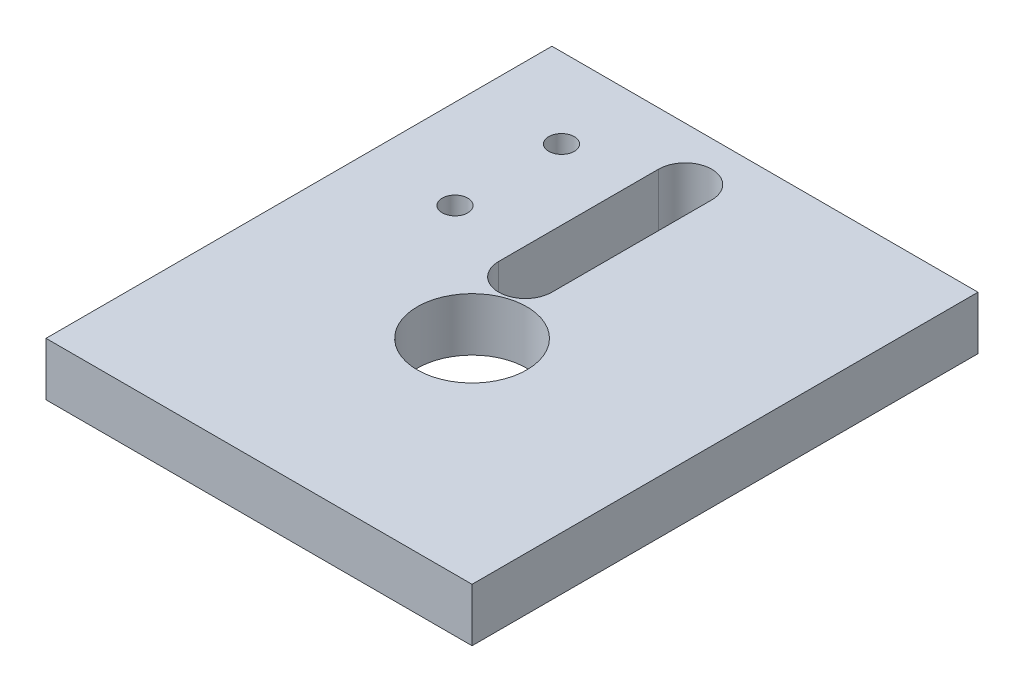
ISO-10303-21;
HEADER;
FILE_DESCRIPTION(('STEP AP214'),'2;1');
FILE_NAME('part.step','',(''),(''),'','','');
FILE_SCHEMA(('AUTOMOTIVE_DESIGN { 1 0 10303 214 1 1 1 1 }'));
ENDSEC;
DATA;
#1=APPLICATION_CONTEXT('core data for automotive mechanical design processes');
#2=APPLICATION_PROTOCOL_DEFINITION('international standard','automotive_design',2000,#1);
#3=PRODUCT_CONTEXT('',#1,'mechanical');
#4=PRODUCT('Part','Part','',(#3));
#5=PRODUCT_RELATED_PRODUCT_CATEGORY('part','',(#4));
#6=PRODUCT_DEFINITION_FORMATION('','',#4);
#7=PRODUCT_DEFINITION_CONTEXT('part definition',#1,'design');
#8=PRODUCT_DEFINITION('design','',#6,#7);
#9=PRODUCT_DEFINITION_SHAPE('','',#8);
#10=(LENGTH_UNIT() NAMED_UNIT(*) SI_UNIT(.MILLI.,.METRE.));
#11=(NAMED_UNIT(*) PLANE_ANGLE_UNIT() SI_UNIT($,.RADIAN.));
#12=(NAMED_UNIT(*) SI_UNIT($,.STERADIAN.) SOLID_ANGLE_UNIT());
#13=UNCERTAINTY_MEASURE_WITH_UNIT(LENGTH_MEASURE(1.E-05),#10,'distance_accuracy_value','');
#14=(GEOMETRIC_REPRESENTATION_CONTEXT(3) GLOBAL_UNCERTAINTY_ASSIGNED_CONTEXT((#13)) GLOBAL_UNIT_ASSIGNED_CONTEXT((#10,
#11,#12)) REPRESENTATION_CONTEXT('',''));
#15=CARTESIAN_POINT('',(0.,0.,0.));
#16=DIRECTION('',(0.,0.,1.));
#17=DIRECTION('',(1.,0.,0.));
#18=AXIS2_PLACEMENT_3D('',#15,#16,#17);
#19=CARTESIAN_POINT('',(0.,3.175,15.08125));
#20=DIRECTION('',(0.,0.,-1.));
#21=DIRECTION('',(-1.,0.,0.));
#22=AXIS2_PLACEMENT_3D('',#19,#20,#21);
#23=PLANE('',#22);
#24=DIRECTION('',(1.,0.,0.));
#25=VECTOR('',#24,1.);
#26=CARTESIAN_POINT('',(0.,0.,15.08125));
#27=LINE('',#26,#25);
#28=CARTESIAN_POINT('',(-12.7,0.,15.08125));
#29=VERTEX_POINT('',#28);
#30=CARTESIAN_POINT('',(12.7,0.,15.08125));
#31=VERTEX_POINT('',#30);
#32=EDGE_CURVE('E150',#29,#31,#27,.T.);
#33=ORIENTED_EDGE('',*,*,#32,.T.);
#34=DIRECTION('',(0.,-1.,0.));
#35=VECTOR('',#34,1.);
#36=CARTESIAN_POINT('',(12.7,3.175,15.08125));
#37=LINE('',#36,#35);
#38=CARTESIAN_POINT('',(12.7,3.175,15.08125));
#39=VERTEX_POINT('',#38);
#40=EDGE_CURVE('E11',#39,#31,#37,.T.);
#41=ORIENTED_EDGE('',*,*,#40,.F.);
#42=DIRECTION('',(1.,0.,0.));
#43=VECTOR('',#42,1.);
#44=CARTESIAN_POINT('',(0.,3.175,15.08125));
#45=LINE('',#44,#43);
#46=CARTESIAN_POINT('',(-12.7,3.175,15.08125));
#47=VERTEX_POINT('',#46);
#48=EDGE_CURVE('E114',#47,#39,#45,.T.);
#49=ORIENTED_EDGE('',*,*,#48,.F.);
#50=DIRECTION('',(0.,-1.,0.));
#51=VECTOR('',#50,1.);
#52=CARTESIAN_POINT('',(-12.7,3.175,15.08125));
#53=LINE('',#52,#51);
#54=EDGE_CURVE('E54',#47,#29,#53,.T.);
#55=ORIENTED_EDGE('',*,*,#54,.T.);
#56=EDGE_LOOP('',(#33,#41,#49,#55));
#57=FACE_BOUND('',#56,.T.);
#58=ADVANCED_FACE('F35',(#57),#23,.F.);
#59=CARTESIAN_POINT('',(12.7,3.175,0.));
#60=DIRECTION('',(-1.,0.,0.));
#61=DIRECTION('',(0.,0.,1.));
#62=AXIS2_PLACEMENT_3D('',#59,#60,#61);
#63=PLANE('',#62);
#64=DIRECTION('',(0.,0.,-1.));
#65=VECTOR('',#64,1.);
#66=CARTESIAN_POINT('',(12.7,0.,0.));
#67=LINE('',#66,#65);
#68=CARTESIAN_POINT('',(12.7,0.,-15.08125));
#69=VERTEX_POINT('',#68);
#70=EDGE_CURVE('E120',#31,#69,#67,.T.);
#71=ORIENTED_EDGE('',*,*,#70,.T.);
#72=DIRECTION('',(0.,-1.,0.));
#73=VECTOR('',#72,1.);
#74=CARTESIAN_POINT('',(12.7,3.175,-15.08125));
#75=LINE('',#74,#73);
#76=CARTESIAN_POINT('',(12.7,3.175,-15.08125));
#77=VERTEX_POINT('',#76);
#78=EDGE_CURVE('E45',#77,#69,#75,.T.);
#79=ORIENTED_EDGE('',*,*,#78,.F.);
#80=DIRECTION('',(0.,0.,-1.));
#81=VECTOR('',#80,1.);
#82=CARTESIAN_POINT('',(12.7,3.175,0.));
#83=LINE('',#82,#81);
#84=EDGE_CURVE('E108',#39,#77,#83,.T.);
#85=ORIENTED_EDGE('',*,*,#84,.F.);
#86=ORIENTED_EDGE('',*,*,#40,.T.);
#87=EDGE_LOOP('',(#71,#79,#85,#86));
#88=FACE_BOUND('',#87,.T.);
#89=ADVANCED_FACE('F119',(#88),#63,.F.);
#90=CARTESIAN_POINT('',(0.,3.175,-15.08125));
#91=DIRECTION('',(0.,0.,-1.));
#92=DIRECTION('',(-1.,0.,0.));
#93=AXIS2_PLACEMENT_3D('',#90,#91,#92);
#94=PLANE('',#93);
#95=DIRECTION('',(1.,0.,0.));
#96=VECTOR('',#95,1.);
#97=CARTESIAN_POINT('',(0.,0.,-15.08125));
#98=LINE('',#97,#96);
#99=CARTESIAN_POINT('',(-12.7,0.,-15.08125));
#100=VERTEX_POINT('',#99);
#101=EDGE_CURVE('E153',#100,#69,#98,.T.);
#102=ORIENTED_EDGE('',*,*,#101,.F.);
#103=DIRECTION('',(0.,-1.,0.));
#104=VECTOR('',#103,1.);
#105=CARTESIAN_POINT('',(-12.7,3.175,-15.08125));
#106=LINE('',#105,#104);
#107=CARTESIAN_POINT('',(-12.7,3.175,-15.08125));
#108=VERTEX_POINT('',#107);
#109=EDGE_CURVE('E80',#108,#100,#106,.T.);
#110=ORIENTED_EDGE('',*,*,#109,.F.);
#111=DIRECTION('',(1.,0.,0.));
#112=VECTOR('',#111,1.);
#113=CARTESIAN_POINT('',(0.,3.175,-15.08125));
#114=LINE('',#113,#112);
#115=EDGE_CURVE('E113',#108,#77,#114,.T.);
#116=ORIENTED_EDGE('',*,*,#115,.T.);
#117=ORIENTED_EDGE('',*,*,#78,.T.);
#118=EDGE_LOOP('',(#102,#110,#116,#117));
#119=FACE_BOUND('',#118,.T.);
#120=ADVANCED_FACE('F124',(#119),#94,.T.);
#121=CARTESIAN_POINT('',(-1.5875,3.175,-2.38125));
#122=DIRECTION('',(0.,-1.,0.));
#123=DIRECTION('',(0.,0.,-1.));
#124=AXIS2_PLACEMENT_3D('',#121,#122,#123);
#125=CYLINDRICAL_SURFACE('',#124,1.5875);
#126=CARTESIAN_POINT('',(-1.5875,0.,-2.38125));
#127=DIRECTION('',(0.,1.,0.));
#128=DIRECTION('',(0.,0.,1.));
#129=AXIS2_PLACEMENT_3D('',#126,#127,#128);
#130=CIRCLE('',#129,1.5875);
#131=CARTESIAN_POINT('',(-3.175,0.,-2.38125));
#132=VERTEX_POINT('',#131);
#133=CARTESIAN_POINT('',(0.,0.,-2.38125));
#134=VERTEX_POINT('',#133);
#135=EDGE_CURVE('E131',#132,#134,#130,.T.);
#136=ORIENTED_EDGE('',*,*,#135,.F.);
#137=DIRECTION('',(0.,-1.,0.));
#138=VECTOR('',#137,1.);
#139=CARTESIAN_POINT('',(-3.175,3.175,-2.38125));
#140=LINE('',#139,#138);
#141=CARTESIAN_POINT('',(-3.175,3.175,-2.38125));
#142=VERTEX_POINT('',#141);
#143=EDGE_CURVE('E39',#142,#132,#140,.T.);
#144=ORIENTED_EDGE('',*,*,#143,.F.);
#145=CARTESIAN_POINT('',(-1.5875,3.175,-2.38125));
#146=DIRECTION('',(0.,1.,0.));
#147=DIRECTION('',(0.,0.,1.));
#148=AXIS2_PLACEMENT_3D('',#145,#146,#147);
#149=CIRCLE('',#148,1.5875);
#150=CARTESIAN_POINT('',(0.,3.175,-2.38125));
#151=VERTEX_POINT('',#150);
#152=EDGE_CURVE('E158',#142,#151,#149,.T.);
#153=ORIENTED_EDGE('',*,*,#152,.T.);
#154=DIRECTION('',(0.,-1.,0.));
#155=VECTOR('',#154,1.);
#156=CARTESIAN_POINT('',(0.,3.175,-2.38125));
#157=LINE('',#156,#155);
#158=EDGE_CURVE('E127',#151,#134,#157,.T.);
#159=ORIENTED_EDGE('',*,*,#158,.T.);
#160=EDGE_LOOP('',(#136,#144,#153,#159));
#161=FACE_BOUND('',#160,.T.);
#162=ADVANCED_FACE('F37',(#161),#125,.F.);
#163=CARTESIAN_POINT('',(-3.175,3.175,0.));
#164=DIRECTION('',(1.,0.,0.));
#165=DIRECTION('',(0.,0.,-1.));
#166=AXIS2_PLACEMENT_3D('',#163,#164,#165);
#167=PLANE('',#166);
#168=DIRECTION('',(0.,0.,1.));
#169=VECTOR('',#168,1.);
#170=CARTESIAN_POINT('',(-3.175,0.,0.));
#171=LINE('',#170,#169);
#172=CARTESIAN_POINT('',(-3.175,0.,-11.90625));
#173=VERTEX_POINT('',#172);
#174=EDGE_CURVE('E134',#173,#132,#171,.T.);
#175=ORIENTED_EDGE('',*,*,#174,.F.);
#176=DIRECTION('',(0.,-1.,0.));
#177=VECTOR('',#176,1.);
#178=CARTESIAN_POINT('',(-3.175,3.175,-11.90625));
#179=LINE('',#178,#177);
#180=CARTESIAN_POINT('',(-3.175,3.175,-11.90625));
#181=VERTEX_POINT('',#180);
#182=EDGE_CURVE('E163',#181,#173,#179,.T.);
#183=ORIENTED_EDGE('',*,*,#182,.F.);
#184=DIRECTION('',(0.,0.,1.));
#185=VECTOR('',#184,1.);
#186=CARTESIAN_POINT('',(-3.175,3.175,0.));
#187=LINE('',#186,#185);
#188=EDGE_CURVE('E172',#181,#142,#187,.T.);
#189=ORIENTED_EDGE('',*,*,#188,.T.);
#190=ORIENTED_EDGE('',*,*,#143,.T.);
#191=EDGE_LOOP('',(#175,#183,#189,#190));
#192=FACE_BOUND('',#191,.T.);
#193=ADVANCED_FACE('F170',(#192),#167,.T.);
#194=CARTESIAN_POINT('',(-1.5875,3.175,-11.90625));
#195=DIRECTION('',(0.,-1.,0.));
#196=DIRECTION('',(0.,0.,-1.));
#197=AXIS2_PLACEMENT_3D('',#194,#195,#196);
#198=CYLINDRICAL_SURFACE('',#197,1.5875);
#199=CARTESIAN_POINT('',(-1.5875,0.,-11.90625));
#200=DIRECTION('',(0.,1.,0.));
#201=DIRECTION('',(0.,0.,1.));
#202=AXIS2_PLACEMENT_3D('',#199,#200,#201);
#203=CIRCLE('',#202,1.5875);
#204=CARTESIAN_POINT('',(0.,0.,-11.90625));
#205=VERTEX_POINT('',#204);
#206=EDGE_CURVE('E138',#205,#173,#203,.T.);
#207=ORIENTED_EDGE('',*,*,#206,.F.);
#208=DIRECTION('',(0.,-1.,0.));
#209=VECTOR('',#208,1.);
#210=CARTESIAN_POINT('',(0.,3.175,-11.90625));
#211=LINE('',#210,#209);
#212=CARTESIAN_POINT('',(0.,3.175,-11.90625));
#213=VERTEX_POINT('',#212);
#214=EDGE_CURVE('E162',#213,#205,#211,.T.);
#215=ORIENTED_EDGE('',*,*,#214,.F.);
#216=CARTESIAN_POINT('',(-1.5875,3.175,-11.90625));
#217=DIRECTION('',(0.,1.,0.));
#218=DIRECTION('',(0.,0.,1.));
#219=AXIS2_PLACEMENT_3D('',#216,#217,#218);
#220=CIRCLE('',#219,1.5875);
#221=EDGE_CURVE('E181',#213,#181,#220,.T.);
#222=ORIENTED_EDGE('',*,*,#221,.T.);
#223=ORIENTED_EDGE('',*,*,#182,.T.);
#224=EDGE_LOOP('',(#207,#215,#222,#223));
#225=FACE_BOUND('',#224,.T.);
#226=ADVANCED_FACE('F178',(#225),#198,.F.);
#227=CARTESIAN_POINT('',(-7.366,3.175,-3.96875));
#228=DIRECTION('',(0.,-1.,0.));
#229=DIRECTION('',(0.,0.,-1.));
#230=AXIS2_PLACEMENT_3D('',#227,#228,#229);
#231=CYLINDRICAL_SURFACE('',#230,0.761999999999999);
#232=CARTESIAN_POINT('',(-7.366,3.175,-3.96875));
#233=DIRECTION('',(0.,1.,0.));
#234=DIRECTION('',(0.,0.,1.));
#235=AXIS2_PLACEMENT_3D('',#232,#233,#234);
#236=CIRCLE('',#235,0.761999999999999);
#237=CARTESIAN_POINT('',(-7.366,3.175,-3.20675));
#238=VERTEX_POINT('',#237);
#239=EDGE_CURVE('E195',#238,#238,#236,.T.);
#240=ORIENTED_EDGE('',*,*,#239,.T.);
#241=EDGE_LOOP('',(#240));
#242=FACE_BOUND('',#241,.T.);
#243=CARTESIAN_POINT('',(-7.366,0.,-3.96875));
#244=DIRECTION('',(0.,1.,0.));
#245=DIRECTION('',(0.,0.,1.));
#246=AXIS2_PLACEMENT_3D('',#243,#244,#245);
#247=CIRCLE('',#246,0.761999999999999);
#248=CARTESIAN_POINT('',(-7.366,0.,-3.20675));
#249=VERTEX_POINT('',#248);
#250=EDGE_CURVE('E147',#249,#249,#247,.T.);
#251=ORIENTED_EDGE('',*,*,#250,.F.);
#252=EDGE_LOOP('',(#251));
#253=FACE_BOUND('',#252,.T.);
#254=ADVANCED_FACE('F199',(#242,#253),#231,.F.);
#255=CARTESIAN_POINT('',(-7.366,3.175,-10.31875));
#256=DIRECTION('',(0.,-1.,0.));
#257=DIRECTION('',(0.,0.,-1.));
#258=AXIS2_PLACEMENT_3D('',#255,#256,#257);
#259=CYLINDRICAL_SURFACE('',#258,0.761999999999999);
#260=CARTESIAN_POINT('',(-7.366,3.175,-10.31875));
#261=DIRECTION('',(0.,1.,0.));
#262=DIRECTION('',(0.,0.,1.));
#263=AXIS2_PLACEMENT_3D('',#260,#261,#262);
#264=CIRCLE('',#263,0.761999999999999);
#265=CARTESIAN_POINT('',(-7.366,3.175,-9.55675));
#266=VERTEX_POINT('',#265);
#267=EDGE_CURVE('E186',#266,#266,#264,.T.);
#268=ORIENTED_EDGE('',*,*,#267,.T.);
#269=EDGE_LOOP('',(#268));
#270=FACE_BOUND('',#269,.T.);
#271=CARTESIAN_POINT('',(-7.366,0.,-10.31875));
#272=DIRECTION('',(0.,1.,0.));
#273=DIRECTION('',(0.,0.,1.));
#274=AXIS2_PLACEMENT_3D('',#271,#272,#273);
#275=CIRCLE('',#274,0.761999999999999);
#276=CARTESIAN_POINT('',(-7.366,0.,-9.55675));
#277=VERTEX_POINT('',#276);
#278=EDGE_CURVE('E144',#277,#277,#275,.T.);
#279=ORIENTED_EDGE('',*,*,#278,.F.);
#280=EDGE_LOOP('',(#279));
#281=FACE_BOUND('',#280,.T.);
#282=ADVANCED_FACE('F226',(#270,#281),#259,.F.);
#283=CARTESIAN_POINT('',(0.,3.175,0.));
#284=DIRECTION('',(1.,0.,0.));
#285=DIRECTION('',(0.,0.,-1.));
#286=AXIS2_PLACEMENT_3D('',#283,#284,#285);
#287=PLANE('',#286);
#288=DIRECTION('',(0.,0.,1.));
#289=VECTOR('',#288,1.);
#290=CARTESIAN_POINT('',(0.,0.,0.));
#291=LINE('',#290,#289);
#292=EDGE_CURVE('E141',#205,#134,#291,.T.);
#293=ORIENTED_EDGE('',*,*,#292,.T.);
#294=ORIENTED_EDGE('',*,*,#158,.F.);
#295=DIRECTION('',(0.,0.,1.));
#296=VECTOR('',#295,1.);
#297=CARTESIAN_POINT('',(0.,3.175,0.));
#298=LINE('',#297,#296);
#299=EDGE_CURVE('E183',#213,#151,#298,.T.);
#300=ORIENTED_EDGE('',*,*,#299,.F.);
#301=ORIENTED_EDGE('',*,*,#214,.T.);
#302=EDGE_LOOP('',(#293,#294,#300,#301));
#303=FACE_BOUND('',#302,.T.);
#304=ADVANCED_FACE('F184',(#303),#287,.F.);
#305=CARTESIAN_POINT('',(-12.7,3.175,0.));
#306=DIRECTION('',(-1.,0.,0.));
#307=DIRECTION('',(0.,0.,1.));
#308=AXIS2_PLACEMENT_3D('',#305,#306,#307);
#309=PLANE('',#308);
#310=DIRECTION('',(0.,0.,-1.));
#311=VECTOR('',#310,1.);
#312=CARTESIAN_POINT('',(-12.7,0.,0.));
#313=LINE('',#312,#311);
#314=EDGE_CURVE('E155',#29,#100,#313,.T.);
#315=ORIENTED_EDGE('',*,*,#314,.F.);
#316=ORIENTED_EDGE('',*,*,#54,.F.);
#317=DIRECTION('',(0.,0.,-1.));
#318=VECTOR('',#317,1.);
#319=CARTESIAN_POINT('',(-12.7,3.175,0.));
#320=LINE('',#319,#318);
#321=EDGE_CURVE('E125',#47,#108,#320,.T.);
#322=ORIENTED_EDGE('',*,*,#321,.T.);
#323=ORIENTED_EDGE('',*,*,#109,.T.);
#324=EDGE_LOOP('',(#315,#316,#322,#323));
#325=FACE_BOUND('',#324,.T.);
#326=ADVANCED_FACE('F203',(#325),#309,.T.);
#327=CARTESIAN_POINT('',(0.,3.175,0.));
#328=DIRECTION('',(0.,1.,0.));
#329=DIRECTION('',(0.,0.,1.));
#330=AXIS2_PLACEMENT_3D('',#327,#328,#329);
#331=PLANE('',#330);
#332=CARTESIAN_POINT('',(0.,3.175,2.38125));
#333=DIRECTION('',(0.,1.,0.));
#334=DIRECTION('',(0.,0.,1.));
#335=AXIS2_PLACEMENT_3D('',#332,#333,#334);
#336=CIRCLE('',#335,3.26389999999999);
#337=CARTESIAN_POINT('',(0.,3.175,5.64514999999999));
#338=VERTEX_POINT('',#337);
#339=EDGE_CURVE('E312',#338,#338,#336,.T.);
#340=ORIENTED_EDGE('',*,*,#339,.F.);
#341=EDGE_LOOP('',(#340));
#342=FACE_BOUND('',#341,.T.);
#343=ORIENTED_EDGE('',*,*,#152,.F.);
#344=ORIENTED_EDGE('',*,*,#188,.F.);
#345=ORIENTED_EDGE('',*,*,#221,.F.);
#346=ORIENTED_EDGE('',*,*,#299,.T.);
#347=EDGE_LOOP('',(#343,#344,#345,#346));
#348=FACE_BOUND('',#347,.T.);
#349=ORIENTED_EDGE('',*,*,#267,.F.);
#350=EDGE_LOOP('',(#349));
#351=FACE_BOUND('',#350,.T.);
#352=ORIENTED_EDGE('',*,*,#239,.F.);
#353=EDGE_LOOP('',(#352));
#354=FACE_BOUND('',#353,.T.);
#355=ORIENTED_EDGE('',*,*,#48,.T.);
#356=ORIENTED_EDGE('',*,*,#84,.T.);
#357=ORIENTED_EDGE('',*,*,#115,.F.);
#358=ORIENTED_EDGE('',*,*,#321,.F.);
#359=EDGE_LOOP('',(#355,#356,#357,#358));
#360=FACE_BOUND('',#359,.T.);
#361=ADVANCED_FACE('F110',(#342,#348,#351,#354,#360),#331,.T.);
#362=CARTESIAN_POINT('',(0.,0.,0.));
#363=DIRECTION('',(0.,1.,0.));
#364=DIRECTION('',(0.,0.,1.));
#365=AXIS2_PLACEMENT_3D('',#362,#363,#364);
#366=PLANE('',#365);
#367=CARTESIAN_POINT('',(0.,0.,2.38125));
#368=DIRECTION('',(0.,1.,0.));
#369=DIRECTION('',(0.,0.,1.));
#370=AXIS2_PLACEMENT_3D('',#367,#368,#369);
#371=CIRCLE('',#370,3.26389999999999);
#372=CARTESIAN_POINT('',(0.,0.,5.64514999999999));
#373=VERTEX_POINT('',#372);
#374=EDGE_CURVE('E135',#373,#373,#371,.T.);
#375=ORIENTED_EDGE('',*,*,#374,.T.);
#376=EDGE_LOOP('',(#375));
#377=FACE_BOUND('',#376,.T.);
#378=ORIENTED_EDGE('',*,*,#135,.T.);
#379=ORIENTED_EDGE('',*,*,#292,.F.);
#380=ORIENTED_EDGE('',*,*,#206,.T.);
#381=ORIENTED_EDGE('',*,*,#174,.T.);
#382=EDGE_LOOP('',(#378,#379,#380,#381));
#383=FACE_BOUND('',#382,.T.);
#384=ORIENTED_EDGE('',*,*,#278,.T.);
#385=EDGE_LOOP('',(#384));
#386=FACE_BOUND('',#385,.T.);
#387=ORIENTED_EDGE('',*,*,#250,.T.);
#388=EDGE_LOOP('',(#387));
#389=FACE_BOUND('',#388,.T.);
#390=ORIENTED_EDGE('',*,*,#32,.F.);
#391=ORIENTED_EDGE('',*,*,#314,.T.);
#392=ORIENTED_EDGE('',*,*,#101,.T.);
#393=ORIENTED_EDGE('',*,*,#70,.F.);
#394=EDGE_LOOP('',(#390,#391,#392,#393));
#395=FACE_BOUND('',#394,.T.);
#396=ADVANCED_FACE('F176',(#377,#383,#386,#389,#395),#366,.F.);
#397=CARTESIAN_POINT('',(0.,3.175,2.38125));
#398=DIRECTION('',(0.,1.,0.));
#399=DIRECTION('',(0.,0.,1.));
#400=AXIS2_PLACEMENT_3D('',#397,#398,#399);
#401=CYLINDRICAL_SURFACE('',#400,3.26389999999999);
#402=ORIENTED_EDGE('',*,*,#339,.T.);
#403=EDGE_LOOP('',(#402));
#404=FACE_BOUND('',#403,.T.);
#405=ORIENTED_EDGE('',*,*,#374,.F.);
#406=EDGE_LOOP('',(#405));
#407=FACE_BOUND('',#406,.T.);
#408=ADVANCED_FACE('F210',(#404,#407),#401,.F.);
#409=CLOSED_SHELL('',(#58,#89,#120,#162,#193,#226,#254,#282,#304,#326,#361,#396,#408));
#410=MANIFOLD_SOLID_BREP('B2',#409);
#411=ADVANCED_BREP_SHAPE_REPRESENTATION('',(#18,#410),#14);
#412=SHAPE_DEFINITION_REPRESENTATION(#9,#411);
ENDSEC;
END-ISO-10303-21;
